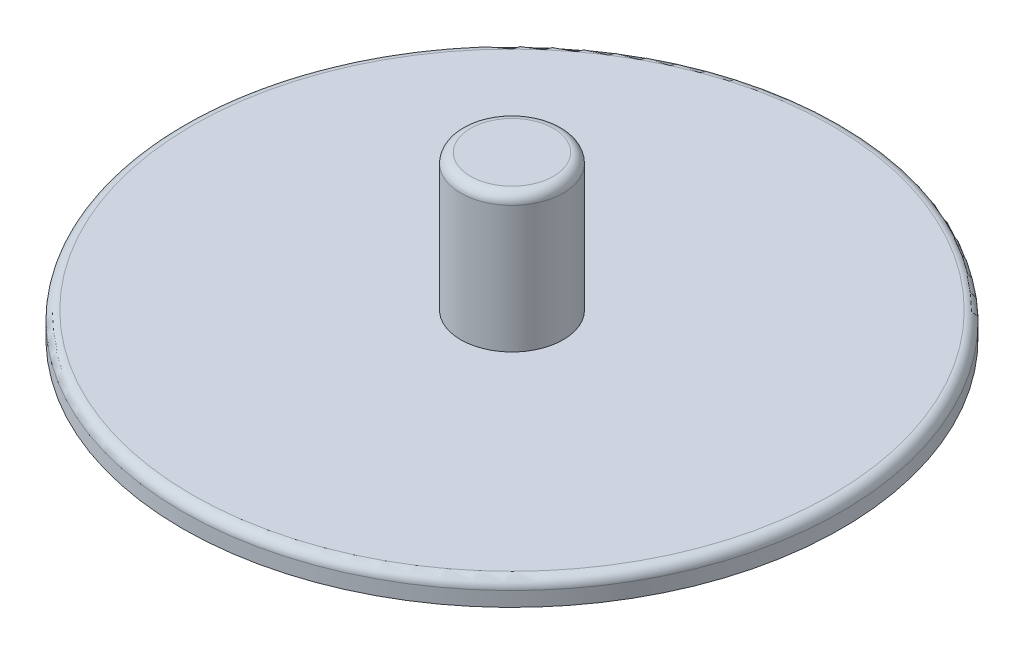
ISO-10303-21;
HEADER;
FILE_DESCRIPTION(('STEP AP214'),'2;1');
FILE_NAME('part.step','',(''),(''),'','','');
FILE_SCHEMA(('AUTOMOTIVE_DESIGN { 1 0 10303 214 1 1 1 1 }'));
ENDSEC;
DATA;
#1=APPLICATION_CONTEXT('core data for automotive mechanical design processes');
#2=APPLICATION_PROTOCOL_DEFINITION('international standard','automotive_design',2000,#1);
#3=PRODUCT_CONTEXT('',#1,'mechanical');
#4=PRODUCT('Part','Part','',(#3));
#5=PRODUCT_RELATED_PRODUCT_CATEGORY('part','',(#4));
#6=PRODUCT_DEFINITION_FORMATION('','',#4);
#7=PRODUCT_DEFINITION_CONTEXT('part definition',#1,'design');
#8=PRODUCT_DEFINITION('design','',#6,#7);
#9=PRODUCT_DEFINITION_SHAPE('','',#8);
#10=(LENGTH_UNIT() NAMED_UNIT(*) SI_UNIT(.MILLI.,.METRE.));
#11=(NAMED_UNIT(*) PLANE_ANGLE_UNIT() SI_UNIT($,.RADIAN.));
#12=(NAMED_UNIT(*) SI_UNIT($,.STERADIAN.) SOLID_ANGLE_UNIT());
#13=UNCERTAINTY_MEASURE_WITH_UNIT(LENGTH_MEASURE(1.E-05),#10,'distance_accuracy_value','');
#14=(GEOMETRIC_REPRESENTATION_CONTEXT(3) GLOBAL_UNCERTAINTY_ASSIGNED_CONTEXT((#13)) GLOBAL_UNIT_ASSIGNED_CONTEXT((#10,
#11,#12)) REPRESENTATION_CONTEXT('',''));
#15=CARTESIAN_POINT('',(0.,0.,0.));
#16=DIRECTION('',(0.,0.,1.));
#17=DIRECTION('',(1.,0.,0.));
#18=AXIS2_PLACEMENT_3D('',#15,#16,#17);
#19=CARTESIAN_POINT('',(0.,6.35,0.));
#20=DIRECTION('',(0.,-1.,0.));
#21=DIRECTION('',(0.,0.,-1.));
#22=AXIS2_PLACEMENT_3D('',#19,#20,#21);
#23=CYLINDRICAL_SURFACE('',#22,85.725);
#24=CARTESIAN_POINT('',(0.,3.81,0.));
#25=DIRECTION('',(0.,1.,0.));
#26=DIRECTION('',(0.,0.,1.));
#27=AXIS2_PLACEMENT_3D('',#24,#25,#26);
#28=CIRCLE('',#27,85.725);
#29=CARTESIAN_POINT('',(0.,3.81,85.725));
#30=VERTEX_POINT('',#29);
#31=EDGE_CURVE('E10',#30,#30,#28,.F.);
#32=ORIENTED_EDGE('',*,*,#31,.T.);
#33=EDGE_LOOP('',(#32));
#34=FACE_BOUND('',#33,.T.);
#35=CARTESIAN_POINT('',(0.,0.,0.));
#36=DIRECTION('',(0.,1.,0.));
#37=DIRECTION('',(0.,0.,1.));
#38=AXIS2_PLACEMENT_3D('',#35,#36,#37);
#39=CIRCLE('',#38,85.725);
#40=CARTESIAN_POINT('',(0.,0.,85.725));
#41=VERTEX_POINT('',#40);
#42=EDGE_CURVE('E53',#41,#41,#39,.T.);
#43=ORIENTED_EDGE('',*,*,#42,.T.);
#44=EDGE_LOOP('',(#43));
#45=FACE_BOUND('',#44,.T.);
#46=ADVANCED_FACE('F32',(#34,#45),#23,.T.);
#47=CARTESIAN_POINT('',(0.,6.35,0.));
#48=DIRECTION('',(0.,1.,0.));
#49=DIRECTION('',(0.,0.,1.));
#50=AXIS2_PLACEMENT_3D('',#47,#48,#49);
#51=PLANE('',#50);
#52=CARTESIAN_POINT('',(0.,6.35,0.));
#53=DIRECTION('',(0.,1.,0.));
#54=DIRECTION('',(0.,0.,1.));
#55=AXIS2_PLACEMENT_3D('',#52,#53,#54);
#56=CIRCLE('',#55,83.185);
#57=CARTESIAN_POINT('',(0.,6.35,83.185));
#58=VERTEX_POINT('',#57);
#59=EDGE_CURVE('E39',#58,#58,#56,.T.);
#60=ORIENTED_EDGE('',*,*,#59,.T.);
#61=EDGE_LOOP('',(#60));
#62=FACE_BOUND('',#61,.T.);
#63=CARTESIAN_POINT('',(0.,6.35,0.));
#64=DIRECTION('',(0.,1.,0.));
#65=DIRECTION('',(0.,0.,1.));
#66=AXIS2_PLACEMENT_3D('',#63,#64,#65);
#67=CIRCLE('',#66,13.335);
#68=CARTESIAN_POINT('',(0.,6.35,13.335));
#69=VERTEX_POINT('',#68);
#70=EDGE_CURVE('E52',#69,#69,#67,.T.);
#71=ORIENTED_EDGE('',*,*,#70,.F.);
#72=EDGE_LOOP('',(#71));
#73=FACE_BOUND('',#72,.T.);
#74=ADVANCED_FACE('F61',(#62,#73),#51,.T.);
#75=CARTESIAN_POINT('',(0.,0.,0.));
#76=DIRECTION('',(0.,1.,0.));
#77=DIRECTION('',(0.,0.,1.));
#78=AXIS2_PLACEMENT_3D('',#75,#76,#77);
#79=PLANE('',#78);
#80=ORIENTED_EDGE('',*,*,#42,.F.);
#81=EDGE_LOOP('',(#80));
#82=FACE_BOUND('',#81,.T.);
#83=ADVANCED_FACE('F63',(#82),#79,.F.);
#84=CARTESIAN_POINT('',(0.,41.91,0.));
#85=DIRECTION('',(0.,-1.,0.));
#86=DIRECTION('',(0.,0.,-1.));
#87=AXIS2_PLACEMENT_3D('',#84,#85,#86);
#88=CYLINDRICAL_SURFACE('',#87,13.335);
#89=CARTESIAN_POINT('',(0.,39.37,0.));
#90=DIRECTION('',(0.,1.,0.));
#91=DIRECTION('',(0.,0.,1.));
#92=AXIS2_PLACEMENT_3D('',#89,#90,#91);
#93=CIRCLE('',#92,13.335);
#94=CARTESIAN_POINT('',(0.,39.37,13.335));
#95=VERTEX_POINT('',#94);
#96=EDGE_CURVE('E43',#95,#95,#93,.F.);
#97=ORIENTED_EDGE('',*,*,#96,.T.);
#98=EDGE_LOOP('',(#97));
#99=FACE_BOUND('',#98,.T.);
#100=ORIENTED_EDGE('',*,*,#70,.T.);
#101=EDGE_LOOP('',(#100));
#102=FACE_BOUND('',#101,.T.);
#103=ADVANCED_FACE('F59',(#99,#102),#88,.T.);
#104=CARTESIAN_POINT('',(0.,41.91,0.));
#105=DIRECTION('',(0.,1.,0.));
#106=DIRECTION('',(0.,0.,1.));
#107=AXIS2_PLACEMENT_3D('',#104,#105,#106);
#108=PLANE('',#107);
#109=CARTESIAN_POINT('',(0.,41.91,0.));
#110=DIRECTION('',(0.,1.,0.));
#111=DIRECTION('',(0.,0.,1.));
#112=AXIS2_PLACEMENT_3D('',#109,#110,#111);
#113=CIRCLE('',#112,10.795);
#114=CARTESIAN_POINT('',(0.,41.91,10.795));
#115=VERTEX_POINT('',#114);
#116=EDGE_CURVE('E47',#115,#115,#113,.T.);
#117=ORIENTED_EDGE('',*,*,#116,.T.);
#118=EDGE_LOOP('',(#117));
#119=FACE_BOUND('',#118,.T.);
#120=ADVANCED_FACE('F76',(#119),#108,.T.);
#121=CARTESIAN_POINT('',(0.,39.37,0.));
#122=DIRECTION('',(0.,1.,0.));
#123=DIRECTION('',(0.,0.,1.));
#124=AXIS2_PLACEMENT_3D('',#121,#122,#123);
#125=TOROIDAL_SURFACE('',#124,10.795,2.54);
#126=ORIENTED_EDGE('',*,*,#96,.F.);
#127=EDGE_LOOP('',(#126));
#128=FACE_BOUND('',#127,.T.);
#129=ORIENTED_EDGE('',*,*,#116,.F.);
#130=EDGE_LOOP('',(#129));
#131=FACE_BOUND('',#130,.T.);
#132=ADVANCED_FACE('F74',(#128,#131),#125,.T.);
#133=CARTESIAN_POINT('',(0.,3.81,0.));
#134=DIRECTION('',(0.,1.,0.));
#135=DIRECTION('',(0.,0.,1.));
#136=AXIS2_PLACEMENT_3D('',#133,#134,#135);
#137=TOROIDAL_SURFACE('',#136,83.185,2.54);
#138=ORIENTED_EDGE('',*,*,#31,.F.);
#139=EDGE_LOOP('',(#138));
#140=FACE_BOUND('',#139,.T.);
#141=ORIENTED_EDGE('',*,*,#59,.F.);
#142=EDGE_LOOP('',(#141));
#143=FACE_BOUND('',#142,.T.);
#144=ADVANCED_FACE('F34',(#140,#143),#137,.T.);
#145=CLOSED_SHELL('',(#46,#74,#83,#103,#120,#132,#144));
#146=MANIFOLD_SOLID_BREP('B2',#145);
#147=ADVANCED_BREP_SHAPE_REPRESENTATION('',(#18,#146),#14);
#148=SHAPE_DEFINITION_REPRESENTATION(#9,#147);
ENDSEC;
END-ISO-10303-21;
